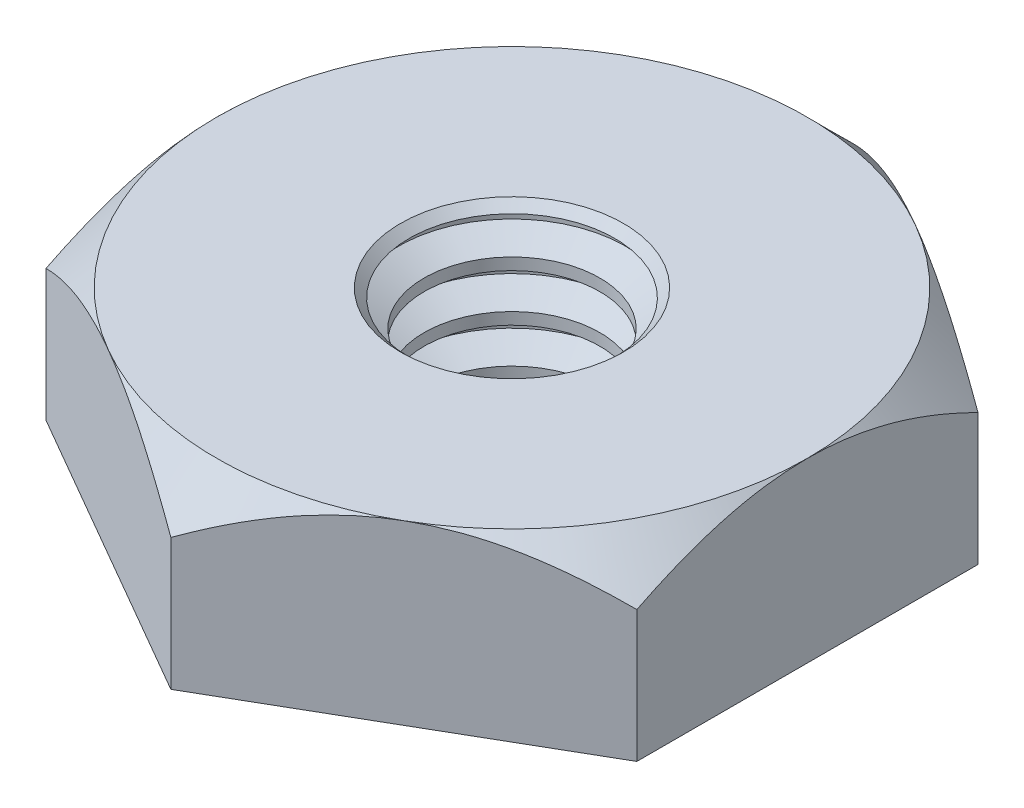
ISO-10303-21;
HEADER;
FILE_DESCRIPTION(('STEP AP214'),'2;1');
FILE_NAME('part.step','',(''),(''),'','','');
FILE_SCHEMA(('AUTOMOTIVE_DESIGN { 1 0 10303 214 1 1 1 1 }'));
ENDSEC;
DATA;
#1=APPLICATION_CONTEXT('core data for automotive mechanical design processes');
#2=APPLICATION_PROTOCOL_DEFINITION('international standard','automotive_design',2000,#1);
#3=PRODUCT_CONTEXT('',#1,'mechanical');
#4=PRODUCT('Part','Part','',(#3));
#5=PRODUCT_RELATED_PRODUCT_CATEGORY('part','',(#4));
#6=PRODUCT_DEFINITION_FORMATION('','',#4);
#7=PRODUCT_DEFINITION_CONTEXT('part definition',#1,'design');
#8=PRODUCT_DEFINITION('design','',#6,#7);
#9=PRODUCT_DEFINITION_SHAPE('','',#8);
#10=(LENGTH_UNIT() NAMED_UNIT(*) SI_UNIT(.MILLI.,.METRE.));
#11=(NAMED_UNIT(*) PLANE_ANGLE_UNIT() SI_UNIT($,.RADIAN.));
#12=(NAMED_UNIT(*) SI_UNIT($,.STERADIAN.) SOLID_ANGLE_UNIT());
#13=UNCERTAINTY_MEASURE_WITH_UNIT(LENGTH_MEASURE(1.E-05),#10,'distance_accuracy_value','');
#14=(GEOMETRIC_REPRESENTATION_CONTEXT(3) GLOBAL_UNCERTAINTY_ASSIGNED_CONTEXT((#13)) GLOBAL_UNIT_ASSIGNED_CONTEXT((#10,
#11,#12)) REPRESENTATION_CONTEXT('',''));
#15=CARTESIAN_POINT('',(0.,0.,0.));
#16=DIRECTION('',(0.,0.,1.));
#17=DIRECTION('',(1.,0.,0.));
#18=AXIS2_PLACEMENT_3D('',#15,#16,#17);
#19=CARTESIAN_POINT('',(0.,1.45716771982052E-13,-2.29135888084666));
#20=DIRECTION('',(0.,1.,0.));
#21=DIRECTION('',(0.,0.,1.00000000000001));
#22=AXIS2_PLACEMENT_3D('',#19,#20,#21);
#23=PLANE('',#22);
#24=DIRECTION('',(-0.866025403784442,0.,-0.500000000000002));
#25=VECTOR('',#24,1.);
#26=CARTESIAN_POINT('',(1.98437500000029,-3.40005801291454E-13,-1.14567944042336));
#27=LINE('',#26,#25);
#28=CARTESIAN_POINT('',(1.98437500000029,-3.40005801291454E-13,-1.14567944042336));
#29=VERTEX_POINT('',#28);
#30=CARTESIAN_POINT('',(0.,1.45716771982052E-13,-2.29135888084666));
#31=VERTEX_POINT('',#30);
#32=EDGE_CURVE('E234',#29,#31,#27,.T.);
#33=ORIENTED_EDGE('',*,*,#32,.F.);
#34=DIRECTION('',(0.,0.,-1.00000000000002));
#35=VECTOR('',#34,1.);
#36=CARTESIAN_POINT('',(1.98437500000005,2.91433543964104E-13,1.14567944042321));
#37=LINE('',#36,#35);
#38=CARTESIAN_POINT('',(1.98437500000005,2.91433543964104E-13,1.14567944042321));
#39=VERTEX_POINT('',#38);
#40=EDGE_CURVE('E291',#39,#29,#37,.T.);
#41=ORIENTED_EDGE('',*,*,#40,.F.);
#42=DIRECTION('',(0.866025403784495,0.,-0.500000000000032));
#43=VECTOR('',#42,1.);
#44=CARTESIAN_POINT('',(2.28983498828939E-13,0.,2.29135888084636));
#45=LINE('',#44,#43);
#46=CARTESIAN_POINT('',(2.28983498828939E-13,0.,2.29135888084636));
#47=VERTEX_POINT('',#46);
#48=EDGE_CURVE('E290',#47,#39,#45,.T.);
#49=ORIENTED_EDGE('',*,*,#48,.F.);
#50=DIRECTION('',(0.866025403784442,0.,0.500000000000002));
#51=VECTOR('',#50,1.);
#52=CARTESIAN_POINT('',(-1.98437499999993,3.88578058618805E-13,1.14567944042318));
#53=LINE('',#52,#51);
#54=CARTESIAN_POINT('',(-1.98437499999993,3.88578058618805E-13,1.14567944042318));
#55=VERTEX_POINT('',#54);
#56=EDGE_CURVE('E126',#55,#47,#53,.T.);
#57=ORIENTED_EDGE('',*,*,#56,.F.);
#58=DIRECTION('',(0.,0.,1.00000000000001));
#59=VECTOR('',#58,1.);
#60=CARTESIAN_POINT('',(-1.98437499999997,-1.45716771982052E-13,-1.14567944042325));
#61=LINE('',#60,#59);
#62=CARTESIAN_POINT('',(-1.98437499999997,-1.45716771982052E-13,-1.14567944042325));
#63=VERTEX_POINT('',#62);
#64=EDGE_CURVE('E296',#63,#55,#61,.T.);
#65=ORIENTED_EDGE('',*,*,#64,.F.);
#66=DIRECTION('',(-0.866025403784495,0.,0.500000000000032));
#67=VECTOR('',#66,1.);
#68=CARTESIAN_POINT('',(0.,1.45716771982052E-13,-2.29135888084666));
#69=LINE('',#68,#67);
#70=EDGE_CURVE('E299',#31,#63,#69,.T.);
#71=ORIENTED_EDGE('',*,*,#70,.F.);
#72=EDGE_LOOP('',(#33,#41,#49,#57,#65,#71));
#73=FACE_BOUND('',#72,.T.);
#74=CARTESIAN_POINT('',(0.,0.,0.));
#75=DIRECTION('',(0.,1.,0.));
#76=DIRECTION('',(0.,0.,1.00000000000001));
#77=AXIS2_PLACEMENT_3D('',#74,#75,#76);
#78=CIRCLE('',#77,0.590148083936524);
#79=CARTESIAN_POINT('',(0.,0.,0.590148083936528));
#80=VERTEX_POINT('',#79);
#81=EDGE_CURVE('E237',#80,#80,#78,.T.);
#82=ORIENTED_EDGE('',*,*,#81,.T.);
#83=EDGE_LOOP('',(#82));
#84=FACE_BOUND('',#83,.T.);
#85=ADVANCED_FACE('F32',(#73,#84),#23,.F.);
#86=CARTESIAN_POINT('',(0.,1.19062500000019,-2.29135888084654));
#87=DIRECTION('',(0.,1.,0.));
#88=DIRECTION('',(0.,0.,1.00000000000001));
#89=AXIS2_PLACEMENT_3D('',#86,#87,#88);
#90=PLANE('',#89);
#91=CARTESIAN_POINT('',(0.,1.19062500000002,0.));
#92=DIRECTION('',(0.,1.,0.));
#93=DIRECTION('',(0.,0.,1.00000000000001));
#94=AXIS2_PLACEMENT_3D('',#91,#92,#93);
#95=CIRCLE('',#94,0.748898083936525);
#96=CARTESIAN_POINT('',(0.,1.19062500000002,0.748898083936498));
#97=VERTEX_POINT('',#96);
#98=EDGE_CURVE('E11',#97,#97,#95,.F.);
#99=ORIENTED_EDGE('',*,*,#98,.T.);
#100=EDGE_LOOP('',(#99));
#101=FACE_BOUND('',#100,.T.);
#102=CARTESIAN_POINT('',(0.,1.19062500000002,0.));
#103=DIRECTION('',(0.,1.,0.));
#104=DIRECTION('',(0.,0.,1.00000000000001));
#105=AXIS2_PLACEMENT_3D('',#102,#103,#104);
#106=CIRCLE('',#105,1.984375);
#107=CARTESIAN_POINT('',(-0.992187500000061,1.19062500000015,1.71851916063472));
#108=VERTEX_POINT('',#107);
#109=CARTESIAN_POINT('',(0.992187500000109,1.19062500000015,1.71851916063475));
#110=VERTEX_POINT('',#109);
#111=EDGE_CURVE('E108',#108,#110,#106,.T.);
#112=ORIENTED_EDGE('',*,*,#111,.T.);
#113=CARTESIAN_POINT('',(0.,1.19062500000002,0.));
#114=DIRECTION('',(0.,1.,0.));
#115=DIRECTION('',(0.,0.,1.00000000000001));
#116=AXIS2_PLACEMENT_3D('',#113,#114,#115);
#117=CIRCLE('',#116,1.984375);
#118=CARTESIAN_POINT('',(1.9843750000002,1.190625,-1.49186218934005E-13));
#119=VERTEX_POINT('',#118);
#120=EDGE_CURVE('E48',#110,#119,#117,.T.);
#121=ORIENTED_EDGE('',*,*,#120,.T.);
#122=CARTESIAN_POINT('',(0.992187500000061,1.19062499999998,-1.71851916063489));
#123=VERTEX_POINT('',#122);
#124=EDGE_CURVE('E141',#119,#123,#106,.T.);
#125=ORIENTED_EDGE('',*,*,#124,.T.);
#126=CARTESIAN_POINT('',(-0.992187499999887,1.19062499999995,-1.71851916063497));
#127=VERTEX_POINT('',#126);
#128=EDGE_CURVE('E145',#123,#127,#106,.T.);
#129=ORIENTED_EDGE('',*,*,#128,.T.);
#130=CARTESIAN_POINT('',(-1.98437499999983,1.1906250000001,0.));
#131=VERTEX_POINT('',#130);
#132=EDGE_CURVE('E148',#127,#131,#106,.T.);
#133=ORIENTED_EDGE('',*,*,#132,.T.);
#134=EDGE_CURVE('E140',#131,#108,#106,.T.);
#135=ORIENTED_EDGE('',*,*,#134,.T.);
#136=EDGE_LOOP('',(#112,#121,#125,#129,#133,#135));
#137=FACE_BOUND('',#136,.T.);
#138=ADVANCED_FACE('F155',(#101,#137),#90,.T.);
#139=CARTESIAN_POINT('',(1.98437500000029,1.19062500000005,-1.14567944042339));
#140=DIRECTION('',(-0.500000000000002,0.,0.866025403784442));
#141=DIRECTION('',(0.866025403784442,0.,0.500000000000002));
#142=AXIS2_PLACEMENT_3D('',#139,#140,#141);
#143=PLANE('',#142);
#144=CARTESIAN_POINT('',(1.9845750000002,0.883525640371882,-1.14556397036938));
#145=CARTESIAN_POINT('',(1.9163590048334,0.922878266889574,-1.18494849354211));
#146=CARTESIAN_POINT('',(1.84700231489325,0.95991980870722,-1.22499159714921));
#147=CARTESIAN_POINT('',(1.70557619954805,1.02774226073004,-1.30664400291425));
#148=CARTESIAN_POINT('',(1.63349332126345,1.05848543006164,-1.34826107209582));
#149=CARTESIAN_POINT('',(1.48814160273421,1.11114923034215,-1.43217992591583));
#150=CARTESIAN_POINT('',(1.41490978751326,1.13320224327334,-1.47446033414689));
#151=CARTESIAN_POINT('',(1.26683381740552,1.16717962620959,-1.55995203534913));
#152=CARTESIAN_POINT('',(1.19199418724684,1.17912936306197,-1.60316071596732));
#153=CARTESIAN_POINT('',(1.06301458545649,1.18991102007171,-1.67762712378094));
#154=CARTESIAN_POINT('',(1.00904128422787,1.19150722009437,-1.70878862377432));
#155=CARTESIAN_POINT('',(0.901182881480525,1.18881928028805,-1.77106070163485));
#156=CARTESIAN_POINT('',(0.847297817514812,1.18453307881295,-1.80217125782076));
#157=CARTESIAN_POINT('',(0.740036461751755,1.1703242461399,-1.8640986304442));
#158=CARTESIAN_POINT('',(0.686660807240232,1.16039530870108,-1.89491507894458));
#159=CARTESIAN_POINT('',(0.58083248259149,1.135446034879,-1.95601509066847));
#160=CARTESIAN_POINT('',(0.528379742029285,1.1204260887643,-1.98629869455186));
#161=CARTESIAN_POINT('',(0.394017661036732,1.0758332675183,-2.06387267818183));
#162=CARTESIAN_POINT('',(0.312941642842077,1.04289812321531,-2.11068193911122));
#163=CARTESIAN_POINT('',(0.19372669327056,0.98729867795128,-2.17951072233773));
#164=CARTESIAN_POINT('',(0.154440075614388,0.967763527101613,-2.20219286161708));
#165=CARTESIAN_POINT('',(0.0765946381322787,0.926912381034187,-2.24713694590256));
#166=CARTESIAN_POINT('',(0.0380353888985849,0.905597479585352,-2.26939913882738));
#167=CARTESIAN_POINT('',(-0.000199999999811462,0.883525640372027,-2.2914743509004));
#168=B_SPLINE_CURVE_WITH_KNOTS('',3,(#144,#145,#146,#147,#148,#149,#150,#151,#152,#153,#154,
#155,#156,#157,#158,#159,#160,#161,#162,#163,#164,#165,#166,#167),.UNSPECIFIED.,.F.,.F.,(4,2,2,
2,2,2,2,2,2,2,2,4),(0.,0.264339630306529,0.530219665093626,0.791876416371418,1.052874244181,
1.23963984393184,1.42647091743834,1.61351120244013,1.8005371524751,2.09764209964292,
2.24579179873695,2.39385111134139),.UNSPECIFIED.);
#169=CARTESIAN_POINT('',(1.98437500000034,0.883641119153724,-1.14567944042333));
#170=VERTEX_POINT('',#169);
#171=EDGE_CURVE('E301',#170,#123,#168,.T.);
#172=ORIENTED_EDGE('',*,*,#171,.F.);
#173=DIRECTION('',(0.,-1.,0.));
#174=VECTOR('',#173,1.);
#175=CARTESIAN_POINT('',(1.98437500000029,1.19062500000005,-1.14567944042339));
#176=LINE('',#175,#174);
#177=EDGE_CURVE('E133',#170,#29,#176,.T.);
#178=ORIENTED_EDGE('',*,*,#177,.T.);
#179=ORIENTED_EDGE('',*,*,#32,.T.);
#180=DIRECTION('',(0.,-1.,0.));
#181=VECTOR('',#180,1.);
#182=CARTESIAN_POINT('',(0.,1.19062500000019,-2.29135888084654));
#183=LINE('',#182,#181);
#184=CARTESIAN_POINT('',(1.2490009027033E-13,0.88364111915387,-2.29135888084661));
#185=VERTEX_POINT('',#184);
#186=EDGE_CURVE('E138',#185,#31,#183,.T.);
#187=ORIENTED_EDGE('',*,*,#186,.F.);
#188=EDGE_CURVE('E206',#123,#185,#168,.T.);
#189=ORIENTED_EDGE('',*,*,#188,.F.);
#190=EDGE_LOOP('',(#172,#178,#179,#187,#189));
#191=FACE_BOUND('',#190,.T.);
#192=ADVANCED_FACE('F34',(#191),#143,.F.);
#193=CARTESIAN_POINT('',(0.,1.19062500000019,-2.29135888084654));
#194=DIRECTION('',(0.50000000000001,0.,0.866025403784456));
#195=DIRECTION('',(0.866025403784456,0.,-0.50000000000001));
#196=AXIS2_PLACEMENT_3D('',#193,#194,#195);
#197=PLANE('',#196);
#198=CARTESIAN_POINT('',(0.000200000000186162,0.883525640372027,-2.29147435090037));
#199=CARTESIAN_POINT('',(-0.068015995166705,0.922878266889732,-2.25208982772778));
#200=CARTESIAN_POINT('',(-0.137372685106893,0.959919808707374,-2.21204672412072));
#201=CARTESIAN_POINT('',(-0.278798800452121,1.02774226073018,-2.13039431835572));
#202=CARTESIAN_POINT('',(-0.3508816787367,1.05848543006178,-2.08877724917415));
#203=CARTESIAN_POINT('',(-0.49623339726591,1.11114923034232,-2.00485839535414));
#204=CARTESIAN_POINT('',(-0.569465212486851,1.13320224327355,-1.9625779871231));
#205=CARTESIAN_POINT('',(-0.717541182594589,1.1671796262097,-1.87708628592085));
#206=CARTESIAN_POINT('',(-0.792380812753271,1.17912936306193,-1.83387760530264));
#207=CARTESIAN_POINT('',(-0.921360414543652,1.18991102007174,-1.75941119748901));
#208=CARTESIAN_POINT('',(-0.97533371577229,1.19150722009453,-1.72824969749563));
#209=CARTESIAN_POINT('',(-1.08319211851966,1.18881928028828,-1.6659776196351));
#210=CARTESIAN_POINT('',(-1.13707718248538,1.18453307881314,-1.63486706344918));
#211=CARTESIAN_POINT('',(-1.24433853824845,1.1703242461401,-1.57293969082572));
#212=CARTESIAN_POINT('',(-1.29771419275999,1.16039530870133,-1.54212324232533));
#213=CARTESIAN_POINT('',(-1.40354251740874,1.13544603487912,-1.48102323060145));
#214=CARTESIAN_POINT('',(-1.45599525797094,1.12042608876425,-1.45073962671809));
#215=CARTESIAN_POINT('',(-1.5903573389635,1.07583326751813,-1.37316564308813));
#216=CARTESIAN_POINT('',(-1.6714333571582,1.04289812321538,-1.32635638215867));
#217=CARTESIAN_POINT('',(-1.79064830672974,0.987298677951452,-1.25752759893214));
#218=CARTESIAN_POINT('',(-1.82993492438591,0.967763527101779,-1.23484545965279));
#219=CARTESIAN_POINT('',(-1.907780361868,0.926912381034287,-1.18990137536732));
#220=CARTESIAN_POINT('',(-1.94633961110167,0.905597479585393,-1.16763918244252));
#221=CARTESIAN_POINT('',(-1.98457500000004,0.883525640372002,-1.14556397036951));
#222=B_SPLINE_CURVE_WITH_KNOTS('',3,(#198,#199,#200,#201,#202,#203,#204,#205,#206,#207,#208,
#209,#210,#211,#212,#213,#214,#215,#216,#217,#218,#219,#220,#221),.UNSPECIFIED.,.F.,.F.,(4,2,2,
2,2,2,2,2,2,2,2,4),(0.,0.264339630306567,0.530219665093623,0.791876416371381,1.05287424418098,
1.23963984393187,1.4264709174384,1.61351120244022,1.80053715247526,2.09764209964308,
2.24579179873709,2.39385111134155),.UNSPECIFIED.);
#223=EDGE_CURVE('E205',#185,#127,#222,.T.);
#224=ORIENTED_EDGE('',*,*,#223,.F.);
#225=ORIENTED_EDGE('',*,*,#186,.T.);
#226=ORIENTED_EDGE('',*,*,#70,.T.);
#227=DIRECTION('',(0.,-1.,0.));
#228=VECTOR('',#227,1.);
#229=CARTESIAN_POINT('',(-1.9843749999998,1.19062500000017,-1.14567944042342));
#230=LINE('',#229,#228);
#231=CARTESIAN_POINT('',(-1.98437499999973,0.883641119153846,-1.14567944042336));
#232=VERTEX_POINT('',#231);
#233=EDGE_CURVE('E131',#232,#63,#230,.T.);
#234=ORIENTED_EDGE('',*,*,#233,.F.);
#235=EDGE_CURVE('E201',#127,#232,#222,.T.);
#236=ORIENTED_EDGE('',*,*,#235,.F.);
#237=EDGE_LOOP('',(#224,#225,#226,#234,#236));
#238=FACE_BOUND('',#237,.T.);
#239=ADVANCED_FACE('F211',(#238),#197,.F.);
#240=CARTESIAN_POINT('',(-1.9843749999998,1.19062500000017,-1.14567944042342));
#241=DIRECTION('',(1.00000000000001,0.,0.));
#242=DIRECTION('',(0.,0.,-1.00000000000001));
#243=AXIS2_PLACEMENT_3D('',#240,#241,#242);
#244=PLANE('',#243);
#245=CARTESIAN_POINT('',(-1.98437500000007,0.0678579907551109,-2.39093858662034));
#246=CARTESIAN_POINT('',(-1.98437499999989,0.1122972409389,-2.33317462993741));
#247=CARTESIAN_POINT('',(-1.98437499999982,0.156338282194557,-2.27509943037781));
#248=CARTESIAN_POINT('',(-1.98437499999977,0.243442020063139,-2.15819933012502));
#249=CARTESIAN_POINT('',(-1.98437499999979,0.286504482746882,-2.09937425531266));
#250=CARTESIAN_POINT('',(-1.9843749999998,0.371775588312892,-1.98041731252039));
#251=CARTESIAN_POINT('',(-1.9843749999998,0.413975081136888,-1.92027886404849));
#252=CARTESIAN_POINT('',(-1.98437499999979,0.496905511909931,-1.79900108789719));
#253=CARTESIAN_POINT('',(-1.98437499999979,0.537636550977846,-1.73786182955753));
#254=CARTESIAN_POINT('',(-1.9843749999998,0.619827468171501,-1.61049038150587));
#255=CARTESIAN_POINT('',(-1.9843749999998,0.661169091834164,-1.5441814987563));
#256=CARTESIAN_POINT('',(-1.98437499999979,0.74127388924578,-1.41002632965806));
#257=CARTESIAN_POINT('',(-1.98437499999979,0.78003739886962,-1.34218024512505));
#258=CARTESIAN_POINT('',(-1.9843749999998,0.854179646043165,-1.2049028594499));
#259=CARTESIAN_POINT('',(-1.98437499999982,0.889567849752302,-1.13547671119946));
#260=CARTESIAN_POINT('',(-1.98437499999977,0.956160104757798,-0.994661805314063));
#261=CARTESIAN_POINT('',(-1.9843749999997,0.987366129905271,-0.923273992828012));
#262=CARTESIAN_POINT('',(-1.98437499999971,1.041645435893,-0.785529199328537));
#263=CARTESIAN_POINT('',(-1.98437499999977,1.06521733345949,-0.719370719882059));
#264=CARTESIAN_POINT('',(-1.98437499999982,1.10706554804224,-0.58536824366753));
#265=CARTESIAN_POINT('',(-1.98437499999981,1.12534152776034,-0.517524139840347));
#266=CARTESIAN_POINT('',(-1.98437499999978,1.15530401629794,-0.381737204849723));
#267=CARTESIAN_POINT('',(-1.98437499999975,1.16711020663641,-0.313821233827045));
#268=CARTESIAN_POINT('',(-1.98437499999984,1.1838868041842,-0.177145514274676));
#269=CARTESIAN_POINT('',(-1.98437499999994,1.18885862962451,-0.108385943793147));
#270=CARTESIAN_POINT('',(-1.98437499999994,1.19154303559346,0.0262685345667429));
#271=CARTESIAN_POINT('',(-1.98437499999983,1.18956325370504,0.0921573633174561));
#272=CARTESIAN_POINT('',(-1.98437499999976,1.17915981582681,0.223420574824771));
#273=CARTESIAN_POINT('',(-1.98437499999978,1.17073557453084,0.288794910308581));
#274=CARTESIAN_POINT('',(-1.98437499999981,1.14777699786801,0.419665277299178));
#275=CARTESIAN_POINT('',(-1.98437499999981,1.13313478805921,0.485142078125713));
#276=CARTESIAN_POINT('',(-1.98437499999978,1.0985501871781,0.614649758192381));
#277=CARTESIAN_POINT('',(-1.98437499999976,1.07860809713262,0.678680719330433));
#278=CARTESIAN_POINT('',(-1.98437499999973,1.00961679847652,0.875717832674248));
#279=CARTESIAN_POINT('',(-1.98437499999978,0.952904639568652,1.00603132226824));
#280=CARTESIAN_POINT('',(-1.98437499999981,0.826700203634045,1.26058195656122));
#281=CARTESIAN_POINT('',(-1.9843749999998,0.757162902292389,1.38479567873725));
#282=CARTESIAN_POINT('',(-1.98437499999979,0.64856757359118,1.56435446887965));
#283=CARTESIAN_POINT('',(-1.98437499999979,0.612658177368547,1.62164227943457));
#284=CARTESIAN_POINT('',(-1.9843749999998,0.539304129574248,1.73523414034348));
#285=CARTESIAN_POINT('',(-1.9843749999998,0.501859362896979,1.7915381164872));
#286=CARTESIAN_POINT('',(-1.98437499999979,0.426020221205967,1.90283779085716));
#287=CARTESIAN_POINT('',(-1.98437499999977,0.387635884291048,1.9578403635737));
#288=CARTESIAN_POINT('',(-1.98437499999982,0.309838254060361,2.06709094817849));
#289=CARTESIAN_POINT('',(-1.98437499999988,0.27042524730878,2.12133916389308));
#290=CARTESIAN_POINT('',(-1.98437500000004,0.230590370952489,2.17527099989928));
#291=B_SPLINE_CURVE_WITH_KNOTS('',3,(#245,#246,#247,#248,#249,#250,#251,#252,#253,#254,#255,
#256,#257,#258,#259,#260,#261,#262,#263,#264,#265,#266,#267,#268,#269,#270,#271,#272,#273,#274,
#275,#276,#277,#278,#279,#280,#281,#282,#283,#284,#285,#286,#287,#288,#289,#290),.UNSPECIFIED.,
.F.,.F.,(4,2,2,2,2,2,2,2,2,2,2,2,2,2,2,2,2,2,2,2,2,2,4),(0.,0.218644571730524,0.43734087201854,
0.65772437219861,0.878092667500268,1.11246911818816,1.34681497442158,1.58048298353887,
1.81404031769145,2.02455568418671,2.23508445550601,2.44157461655698,2.64802192139834,
2.8454504064115,3.042896824632,3.24391843811974,3.44492863626074,3.87005188534782,
4.29669701855881,4.49951372894093,4.70234567224412,4.90354910108082,5.10469706516483),.UNSPECIFIED.);
#292=EDGE_CURVE('E160',#232,#131,#291,.T.);
#293=ORIENTED_EDGE('',*,*,#292,.F.);
#294=ORIENTED_EDGE('',*,*,#233,.T.);
#295=ORIENTED_EDGE('',*,*,#64,.T.);
#296=DIRECTION('',(0.,-1.,0.));
#297=VECTOR('',#296,1.);
#298=CARTESIAN_POINT('',(-1.98437499999994,1.19062500000005,1.14567944042317));
#299=LINE('',#298,#297);
#300=CARTESIAN_POINT('',(-1.98437499999995,0.883641119153724,1.14567944042315));
#301=VERTEX_POINT('',#300);
#302=EDGE_CURVE('E128',#301,#55,#299,.T.);
#303=ORIENTED_EDGE('',*,*,#302,.F.);
#304=EDGE_CURVE('E158',#131,#301,#291,.T.);
#305=ORIENTED_EDGE('',*,*,#304,.F.);
#306=EDGE_LOOP('',(#293,#294,#295,#303,#305));
#307=FACE_BOUND('',#306,.T.);
#308=ADVANCED_FACE('F214',(#307),#244,.F.);
#309=CARTESIAN_POINT('',(-1.98437499999994,1.19062500000005,1.14567944042317));
#310=DIRECTION('',(0.500000000000002,0.,-0.866025403784442));
#311=DIRECTION('',(-0.866025403784442,0.,-0.500000000000002));
#312=AXIS2_PLACEMENT_3D('',#309,#310,#311);
#313=PLANE('',#312);
#314=CARTESIAN_POINT('',(-1.98457499999975,0.883525640371881,1.14556397036933));
#315=CARTESIAN_POINT('',(-1.91635900483301,0.922878266889828,1.18494849354195));
#316=CARTESIAN_POINT('',(-1.84700231489289,0.959919808707568,1.22499159714902));
#317=CARTESIAN_POINT('',(-1.70557619954771,1.02774226073043,1.30664400291403));
#318=CARTESIAN_POINT('',(-1.63349332126312,1.058485430062,1.3482610720956));
#319=CARTESIAN_POINT('',(-1.48814160273391,1.11114923034249,1.43217992591559));
#320=CARTESIAN_POINT('',(-1.41490978751298,1.13320224327371,1.47446033414662));
#321=CARTESIAN_POINT('',(-1.26683381740528,1.16717962620986,1.55995203534888));
#322=CARTESIAN_POINT('',(-1.19199418724663,1.17912936306211,1.60316071596711));
#323=CARTESIAN_POINT('',(-1.06301458545626,1.1899110200719,1.67762712378072));
#324=CARTESIAN_POINT('',(-1.0090412842276,1.19150722009465,1.70878862377408));
#325=CARTESIAN_POINT('',(-0.901182881480221,1.18881928028837,1.77106070163459));
#326=CARTESIAN_POINT('',(-0.847297817514505,1.18453307881323,1.80217125782052));
#327=CARTESIAN_POINT('',(-0.740036461751428,1.17032424614018,1.86409863044398));
#328=CARTESIAN_POINT('',(-0.686660807239889,1.16039530870141,1.89491507894439));
#329=CARTESIAN_POINT('',(-0.580832482591122,1.13544603487917,1.95601509066824));
#330=CARTESIAN_POINT('',(-0.528379742028908,1.12042608876427,1.98629869455157));
#331=CARTESIAN_POINT('',(-0.394017661036339,1.07583326751811,2.06387267818151));
#332=CARTESIAN_POINT('',(-0.312941642841664,1.04289812321538,2.11068193911102));
#333=CARTESIAN_POINT('',(-0.193726693270132,0.98729867795147,2.17951072233758));
#334=CARTESIAN_POINT('',(-0.154440075613961,0.967763527101803,2.20219286161692));
#335=CARTESIAN_POINT('',(-0.0765946381318904,0.926912381034268,2.24713694590237));
#336=CARTESIAN_POINT('',(-0.0380353888982353,0.905597479585324,2.26939913882717));
#337=CARTESIAN_POINT('',(0.00020000000007514,0.883525640371832,2.29147435090018));
#338=B_SPLINE_CURVE_WITH_KNOTS('',3,(#314,#315,#316,#317,#318,#319,#320,#321,#322,#323,#324,
#325,#326,#327,#328,#329,#330,#331,#332,#333,#334,#335,#336,#337),.UNSPECIFIED.,.F.,.F.,(4,2,2,
2,2,2,2,2,2,2,2,4),(0.,0.264339630306556,0.530219665093593,0.791876416371302,1.05287424418085,
1.23963984393176,1.42647091743828,1.61351120244011,1.80053715247517,2.09764209964299,
2.245791798737,2.39385111134146),.UNSPECIFIED.);
#339=EDGE_CURVE('E113',#301,#108,#338,.T.);
#340=ORIENTED_EDGE('',*,*,#339,.F.);
#341=ORIENTED_EDGE('',*,*,#302,.T.);
#342=ORIENTED_EDGE('',*,*,#56,.T.);
#343=DIRECTION('',(0.,-1.,0.));
#344=VECTOR('',#343,1.);
#345=CARTESIAN_POINT('',(2.56739074444567E-13,1.190625,2.29135888084642));
#346=LINE('',#345,#344);
#347=CARTESIAN_POINT('',(2.4980018054066E-13,0.883641119153676,2.29135888084643));
#348=VERTEX_POINT('',#347);
#349=EDGE_CURVE('E119',#348,#47,#346,.T.);
#350=ORIENTED_EDGE('',*,*,#349,.F.);
#351=EDGE_CURVE('E104',#108,#348,#338,.T.);
#352=ORIENTED_EDGE('',*,*,#351,.F.);
#353=EDGE_LOOP('',(#340,#341,#342,#350,#352));
#354=FACE_BOUND('',#353,.T.);
#355=ADVANCED_FACE('F124',(#354),#313,.F.);
#356=CARTESIAN_POINT('',(2.56739074444567E-13,1.190625,2.29135888084642));
#357=DIRECTION('',(-0.50000000000001,0.,-0.866025403784456));
#358=DIRECTION('',(-0.866025403784495,0.,0.500000000000032));
#359=AXIS2_PLACEMENT_3D('',#356,#357,#358);
#360=PLANE('',#359);
#361=CARTESIAN_POINT('',(-0.00019999999988779,0.883525640371832,2.29147435090016));
#362=CARTESIAN_POINT('',(0.0680159951669985,0.922878266889646,2.25208982772766));
#363=CARTESIAN_POINT('',(0.137372685107182,0.95991980870735,2.21204672412063));
#364=CARTESIAN_POINT('',(0.278798800452433,1.02774226073021,2.13039431835562));
#365=CARTESIAN_POINT('',(0.350881678737038,1.05848543006181,2.08877724917402));
#366=CARTESIAN_POINT('',(0.496233397266294,1.11114923034228,2.00485839535401));
#367=CARTESIAN_POINT('',(0.569465212487252,1.13320224327344,1.96257798712299));
#368=CARTESIAN_POINT('',(0.71754118259492,1.16717962620971,1.87708628592069));
#369=CARTESIAN_POINT('',(0.792380812753514,1.17912936306213,1.8338776053024));
#370=CARTESIAN_POINT('',(0.921360414543898,1.18991102007185,1.75941119748881));
#371=CARTESIAN_POINT('',(0.975333715772589,1.19150722009446,1.7282496974955));
#372=CARTESIAN_POINT('',(1.08319211852,1.18881928028809,1.66597761963501));
#373=CARTESIAN_POINT('',(1.13707718248572,1.18453307881298,1.63486706344907));
#374=CARTESIAN_POINT('',(1.24433853824881,1.17032424613994,1.57293969082559));
#375=CARTESIAN_POINT('',(1.29771419276037,1.16039530870114,1.54212324232519));
#376=CARTESIAN_POINT('',(1.40354251740915,1.13544603487892,1.4810232306013));
#377=CARTESIAN_POINT('',(1.45599525797136,1.12042608876407,1.45073962671791));
#378=CARTESIAN_POINT('',(1.59035733896392,1.07583326751794,1.37316564308794));
#379=CARTESIAN_POINT('',(1.67143335715862,1.04289812321513,1.3263563821585));
#380=CARTESIAN_POINT('',(1.79064830673014,0.987298677951163,1.25752759893198));
#381=CARTESIAN_POINT('',(1.8299349243863,0.96776352710148,1.23484545965264));
#382=CARTESIAN_POINT('',(1.90778036186839,0.926912381034019,1.18990137536717));
#383=CARTESIAN_POINT('',(1.94633961110208,0.905597479585164,1.16763918244236));
#384=CARTESIAN_POINT('',(1.98457500000047,0.883525640371857,1.14556397036934));
#385=B_SPLINE_CURVE_WITH_KNOTS('',3,(#361,#362,#363,#364,#365,#366,#367,#368,#369,#370,#371,
#372,#373,#374,#375,#376,#377,#378,#379,#380,#381,#382,#383,#384),.UNSPECIFIED.,.F.,.F.,(4,2,2,
2,2,2,2,2,2,2,2,4),(0.,0.264339630306588,0.530219665093735,0.791876416371477,1.05287424418102,
1.23963984393193,1.42647091743849,1.61351120244037,1.80053715247545,2.09764209964327,
2.24579179873727,2.39385111134171),.UNSPECIFIED.);
#386=EDGE_CURVE('E107',#348,#110,#385,.T.);
#387=ORIENTED_EDGE('',*,*,#386,.F.);
#388=ORIENTED_EDGE('',*,*,#349,.T.);
#389=ORIENTED_EDGE('',*,*,#48,.T.);
#390=DIRECTION('',(0.,-1.,0.));
#391=VECTOR('',#390,1.);
#392=CARTESIAN_POINT('',(1.98437500000009,1.19062500000002,1.14567944042316));
#393=LINE('',#392,#391);
#394=CARTESIAN_POINT('',(1.98437500000009,0.8836411191537,1.14567944042314));
#395=VERTEX_POINT('',#394);
#396=EDGE_CURVE('E129',#395,#39,#393,.T.);
#397=ORIENTED_EDGE('',*,*,#396,.F.);
#398=EDGE_CURVE('E122',#110,#395,#385,.T.);
#399=ORIENTED_EDGE('',*,*,#398,.F.);
#400=EDGE_LOOP('',(#387,#388,#389,#397,#399));
#401=FACE_BOUND('',#400,.T.);
#402=ADVANCED_FACE('F117',(#401),#360,.F.);
#403=CARTESIAN_POINT('',(1.98437500000009,1.19062500000002,1.14567944042316));
#404=DIRECTION('',(-1.00000000000002,0.,0.));
#405=DIRECTION('',(0.,0.,1.00000000000002));
#406=AXIS2_PLACEMENT_3D('',#403,#404,#405);
#407=PLANE('',#406);
#408=CARTESIAN_POINT('',(1.98437499999998,0.0678579907549184,-2.39093858662029));
#409=CARTESIAN_POINT('',(1.98437500000005,0.112297240938723,-2.33317462993737));
#410=CARTESIAN_POINT('',(1.98437500000008,0.156338282194383,-2.27509943037778));
#411=CARTESIAN_POINT('',(1.9843750000001,0.243442020062961,-2.15819933012501));
#412=CARTESIAN_POINT('',(1.98437500000009,0.286504482746697,-2.09937425531264));
#413=CARTESIAN_POINT('',(1.98437500000008,0.371775588312703,-1.98041731252037));
#414=CARTESIAN_POINT('',(1.98437500000009,0.413975081136701,-1.92027886404845));
#415=CARTESIAN_POINT('',(1.98437500000009,0.496905511909748,-1.79900108789714));
#416=CARTESIAN_POINT('',(1.98437500000009,0.537636550977663,-1.73786182955748));
#417=CARTESIAN_POINT('',(1.98437500000009,0.619827468171318,-1.6104903815058));
#418=CARTESIAN_POINT('',(1.98437500000008,0.661169091833979,-1.54418149875623));
#419=CARTESIAN_POINT('',(1.98437500000009,0.741273889245598,-1.41002632965797));
#420=CARTESIAN_POINT('',(1.98437500000011,0.780037398869444,-1.34218024512495));
#421=CARTESIAN_POINT('',(1.98437500000007,0.854179646042962,-1.20490285944979));
#422=CARTESIAN_POINT('',(1.98437500000002,0.889567849752066,-1.13547671119934));
#423=CARTESIAN_POINT('',(1.98437500000015,0.956160104757623,-0.994661805313971));
#424=CARTESIAN_POINT('',(1.98437500000034,0.98736612990519,-0.923273992827964));
#425=CARTESIAN_POINT('',(1.98437500000032,1.04164543589289,-0.785529199328496));
#426=CARTESIAN_POINT('',(1.98437500000015,1.06521733345928,-0.719370719881988));
#427=CARTESIAN_POINT('',(1.98437500000002,1.10706554804195,-0.585368243667436));
#428=CARTESIAN_POINT('',(1.98437500000007,1.12534152776008,-0.517524139840261));
#429=CARTESIAN_POINT('',(1.9843750000001,1.15530401629766,-0.381737204849641));
#430=CARTESIAN_POINT('',(1.98437500000009,1.16711020663608,-0.313821233826958));
#431=CARTESIAN_POINT('',(1.98437500000008,1.18388680418397,-0.177145514274601));
#432=CARTESIAN_POINT('',(1.98437500000009,1.18885862962442,-0.108385943793088));
#433=CARTESIAN_POINT('',(1.98437500000009,1.19154303559335,0.0262685345667733));
#434=CARTESIAN_POINT('',(1.98437500000009,1.1895632537048,0.0921573633174742));
#435=CARTESIAN_POINT('',(1.98437500000009,1.17915981582647,0.223420574824778));
#436=CARTESIAN_POINT('',(1.9843750000001,1.17073557453054,0.288794910308588));
#437=CARTESIAN_POINT('',(1.98437500000008,1.14777699786773,0.419665277299178));
#438=CARTESIAN_POINT('',(1.98437500000005,1.1331347880589,0.485142078125705));
#439=CARTESIAN_POINT('',(1.98437500000013,1.09855018717785,0.614649758192384));
#440=CARTESIAN_POINT('',(1.98437500000024,1.07860809713246,0.678680719330455));
#441=CARTESIAN_POINT('',(1.98437500000038,1.00961679847648,0.875717832674286));
#442=CARTESIAN_POINT('',(1.98437500000016,0.952904639568467,1.00603132226822));
#443=CARTESIAN_POINT('',(1.98437500000001,0.826700203633762,1.26058195656116));
#444=CARTESIAN_POINT('',(1.98437500000007,0.757162902292154,1.38479567873723));
#445=CARTESIAN_POINT('',(1.98437500000009,0.648567573590959,1.56435446887965));
#446=CARTESIAN_POINT('',(1.98437500000009,0.612658177368322,1.62164227943457));
#447=CARTESIAN_POINT('',(1.98437500000008,0.539304129574021,1.73523414034349));
#448=CARTESIAN_POINT('',(1.98437500000008,0.501859362896754,1.79153811648721));
#449=CARTESIAN_POINT('',(1.98437500000009,0.42602022120574,1.90283779085718));
#450=CARTESIAN_POINT('',(1.9843750000001,0.387635884290817,1.95784036357371));
#451=CARTESIAN_POINT('',(1.98437500000008,0.309838254060165,2.06709094817851));
#452=CARTESIAN_POINT('',(1.98437500000005,0.270425247308623,2.12133916389312));
#453=CARTESIAN_POINT('',(1.984375,0.230590370952417,2.17527099989937));
#454=B_SPLINE_CURVE_WITH_KNOTS('',3,(#408,#409,#410,#411,#412,#413,#414,#415,#416,#417,#418,
#419,#420,#421,#422,#423,#424,#425,#426,#427,#428,#429,#430,#431,#432,#433,#434,#435,#436,#437,
#438,#439,#440,#441,#442,#443,#444,#445,#446,#447,#448,#449,#450,#451,#452,#453),.UNSPECIFIED.,
.F.,.F.,(4,2,2,2,2,2,2,2,2,2,2,2,2,2,2,2,2,2,2,2,2,2,4),(0.,0.218644571730508,0.437340872018512,
0.657724372198603,0.87809266750028,1.11246911818819,1.34681497442163,1.58048298353892,
1.81404031769148,2.02455568418672,2.23508445550602,2.44157461655699,2.64802192139832,
2.84545040641144,3.04289682463195,3.24391843811968,3.44492863626066,3.87005188534771,
4.29669701855873,4.49951372894087,4.70234567224407,4.90354910108076,5.10469706516474),.UNSPECIFIED.);
#455=EDGE_CURVE('E282',#395,#119,#454,.F.);
#456=ORIENTED_EDGE('',*,*,#455,.F.);
#457=ORIENTED_EDGE('',*,*,#396,.T.);
#458=ORIENTED_EDGE('',*,*,#40,.T.);
#459=ORIENTED_EDGE('',*,*,#177,.F.);
#460=EDGE_CURVE('E191',#119,#170,#454,.F.);
#461=ORIENTED_EDGE('',*,*,#460,.F.);
#462=EDGE_LOOP('',(#456,#457,#458,#459,#461));
#463=FACE_BOUND('',#462,.T.);
#464=ADVANCED_FACE('F287',(#463),#407,.F.);
#465=CARTESIAN_POINT('',(0.,1.19062500000002,0.));
#466=DIRECTION('',(0.,-1.,0.));
#467=DIRECTION('',(0.,0.,-1.00000000000001));
#468=AXIS2_PLACEMENT_3D('',#465,#466,#467);
#469=CONICAL_SURFACE('',#468,1.984375,0.785398163397454);
#470=ORIENTED_EDGE('',*,*,#351,.T.);
#471=ORIENTED_EDGE('',*,*,#386,.T.);
#472=ORIENTED_EDGE('',*,*,#111,.F.);
#473=EDGE_LOOP('',(#470,#471,#472));
#474=FACE_BOUND('',#473,.T.);
#475=ADVANCED_FACE('F106',(#474),#469,.T.);
#476=ORIENTED_EDGE('',*,*,#304,.T.);
#477=ORIENTED_EDGE('',*,*,#339,.T.);
#478=ORIENTED_EDGE('',*,*,#134,.F.);
#479=EDGE_LOOP('',(#476,#477,#478));
#480=FACE_BOUND('',#479,.T.);
#481=ADVANCED_FACE('F157',(#480),#469,.T.);
#482=ORIENTED_EDGE('',*,*,#235,.T.);
#483=ORIENTED_EDGE('',*,*,#292,.T.);
#484=ORIENTED_EDGE('',*,*,#132,.F.);
#485=EDGE_LOOP('',(#482,#483,#484));
#486=FACE_BOUND('',#485,.T.);
#487=ADVANCED_FACE('F307',(#486),#469,.T.);
#488=ORIENTED_EDGE('',*,*,#188,.T.);
#489=ORIENTED_EDGE('',*,*,#223,.T.);
#490=ORIENTED_EDGE('',*,*,#128,.F.);
#491=EDGE_LOOP('',(#488,#489,#490));
#492=FACE_BOUND('',#491,.T.);
#493=ADVANCED_FACE('F184',(#492),#469,.T.);
#494=ORIENTED_EDGE('',*,*,#171,.T.);
#495=ORIENTED_EDGE('',*,*,#124,.F.);
#496=ORIENTED_EDGE('',*,*,#460,.T.);
#497=EDGE_LOOP('',(#494,#495,#496));
#498=FACE_BOUND('',#497,.T.);
#499=ADVANCED_FACE('F178',(#498),#469,.T.);
#500=ORIENTED_EDGE('',*,*,#398,.T.);
#501=ORIENTED_EDGE('',*,*,#455,.T.);
#502=ORIENTED_EDGE('',*,*,#120,.F.);
#503=EDGE_LOOP('',(#500,#501,#502));
#504=FACE_BOUND('',#503,.T.);
#505=ADVANCED_FACE('F183',(#504),#469,.T.);
#506=CARTESIAN_POINT('',(1.04083408558608E-13,1.09140625000002,0.));
#507=DIRECTION('',(0.,-1.,0.));
#508=DIRECTION('',(0.,0.,-1.00000000000001));
#509=AXIS2_PLACEMENT_3D('',#506,#507,#508);
#510=CONICAL_SURFACE('',#509,0.762,1.0471975511966);
#511=CARTESIAN_POINT('',(1.04083408558608E-13,1.13251846714924,0.));
#512=DIRECTION('',(0.,1.,0.));
#513=DIRECTION('',(0.,0.,1.00000000000001));
#514=AXIS2_PLACEMENT_3D('',#511,#512,#513);
#515=CIRCLE('',#514,0.690791551085745);
#516=CARTESIAN_POINT('',(1.04198448461393E-13,1.13251846714924,0.690791551085697));
#517=VERTEX_POINT('',#516);
#518=EDGE_CURVE('E41',#517,#517,#515,.T.);
#519=ORIENTED_EDGE('',*,*,#518,.T.);
#520=EDGE_LOOP('',(#519));
#521=FACE_BOUND('',#520,.T.);
#522=CARTESIAN_POINT('',(1.04083408558608E-13,1.09140625000002,0.));
#523=DIRECTION('',(0.,1.,0.));
#524=DIRECTION('',(0.,0.,1.00000000000001));
#525=AXIS2_PLACEMENT_3D('',#522,#523,#524);
#526=CIRCLE('',#525,0.762);
#527=CARTESIAN_POINT('',(1.04210307050323E-13,1.09140625000002,0.761999999999953));
#528=VERTEX_POINT('',#527);
#529=EDGE_CURVE('E280',#528,#528,#526,.T.);
#530=ORIENTED_EDGE('',*,*,#529,.F.);
#531=EDGE_LOOP('',(#530));
#532=FACE_BOUND('',#531,.T.);
#533=ADVANCED_FACE('F186',(#521,#532),#510,.F.);
#534=CARTESIAN_POINT('',(0.,1.66357854098432,0.));
#535=DIRECTION('',(0.,1.,0.));
#536=DIRECTION('',(0.,0.,1.00000000000001));
#537=AXIS2_PLACEMENT_3D('',#534,#535,#536);
#538=CYLINDRICAL_SURFACE('',#537,0.762);
#539=ORIENTED_EDGE('',*,*,#529,.T.);
#540=EDGE_LOOP('',(#539));
#541=FACE_BOUND('',#540,.T.);
#542=CARTESIAN_POINT('',(1.04083408558608E-13,1.05171875000002,0.));
#543=DIRECTION('',(0.,1.,0.));
#544=DIRECTION('',(0.,0.,1.00000000000001));
#545=AXIS2_PLACEMENT_3D('',#542,#543,#544);
#546=CIRCLE('',#545,0.762);
#547=CARTESIAN_POINT('',(1.04210307050323E-13,1.05171875000002,0.761999999999953));
#548=VERTEX_POINT('',#547);
#549=EDGE_CURVE('E277',#548,#548,#546,.T.);
#550=ORIENTED_EDGE('',*,*,#549,.F.);
#551=EDGE_LOOP('',(#550));
#552=FACE_BOUND('',#551,.T.);
#553=ADVANCED_FACE('F394',(#541,#552),#538,.F.);
#554=CARTESIAN_POINT('',(0.,0.952500000000025,0.));
#555=DIRECTION('',(0.,1.,0.));
#556=DIRECTION('',(0.,0.,1.00000000000001));
#557=AXIS2_PLACEMENT_3D('',#554,#555,#556);
#558=CONICAL_SURFACE('',#557,0.590148083936524,1.0471975511966);
#559=ORIENTED_EDGE('',*,*,#549,.T.);
#560=EDGE_LOOP('',(#559));
#561=FACE_BOUND('',#560,.T.);
#562=CARTESIAN_POINT('',(0.,0.952500000000025,0.));
#563=DIRECTION('',(0.,1.,0.));
#564=DIRECTION('',(0.,0.,1.00000000000001));
#565=AXIS2_PLACEMENT_3D('',#562,#563,#564);
#566=CIRCLE('',#565,0.590148083936524);
#567=CARTESIAN_POINT('',(0.,0.952500000000025,0.590148083936472));
#568=VERTEX_POINT('',#567);
#569=EDGE_CURVE('E274',#568,#568,#566,.T.);
#570=ORIENTED_EDGE('',*,*,#569,.F.);
#571=EDGE_LOOP('',(#570));
#572=FACE_BOUND('',#571,.T.);
#573=ADVANCED_FACE('F402',(#561,#572),#558,.F.);
#574=CARTESIAN_POINT('',(0.,1.66357854098432,0.));
#575=DIRECTION('',(0.,1.,0.));
#576=DIRECTION('',(0.,0.,1.00000000000001));
#577=AXIS2_PLACEMENT_3D('',#574,#575,#576);
#578=CYLINDRICAL_SURFACE('',#577,0.590148083936524);
#579=ORIENTED_EDGE('',*,*,#569,.T.);
#580=EDGE_LOOP('',(#579));
#581=FACE_BOUND('',#580,.T.);
#582=CARTESIAN_POINT('',(0.,0.873125000000024,0.));
#583=DIRECTION('',(0.,1.,0.));
#584=DIRECTION('',(0.,0.,1.00000000000001));
#585=AXIS2_PLACEMENT_3D('',#582,#583,#584);
#586=CIRCLE('',#585,0.590148083936524);
#587=CARTESIAN_POINT('',(0.,0.873125000000024,0.590148083936472));
#588=VERTEX_POINT('',#587);
#589=EDGE_CURVE('E271',#588,#588,#586,.T.);
#590=ORIENTED_EDGE('',*,*,#589,.F.);
#591=EDGE_LOOP('',(#590));
#592=FACE_BOUND('',#591,.T.);
#593=ADVANCED_FACE('F411',(#581,#592),#578,.F.);
#594=CARTESIAN_POINT('',(1.31838984174237E-13,0.773906250000024,0.));
#595=DIRECTION('',(0.,-1.,0.));
#596=DIRECTION('',(0.,0.,-1.00000000000001));
#597=AXIS2_PLACEMENT_3D('',#594,#595,#596);
#598=CONICAL_SURFACE('',#597,0.762,1.0471975511966);
#599=ORIENTED_EDGE('',*,*,#589,.T.);
#600=EDGE_LOOP('',(#599));
#601=FACE_BOUND('',#600,.T.);
#602=CARTESIAN_POINT('',(1.31838984174237E-13,0.773906250000024,0.));
#603=DIRECTION('',(0.,1.,0.));
#604=DIRECTION('',(0.,0.,1.00000000000001));
#605=AXIS2_PLACEMENT_3D('',#602,#603,#604);
#606=CIRCLE('',#605,0.762);
#607=CARTESIAN_POINT('',(1.31965882665952E-13,0.773906250000024,0.761999999999946));
#608=VERTEX_POINT('',#607);
#609=EDGE_CURVE('E268',#608,#608,#606,.T.);
#610=ORIENTED_EDGE('',*,*,#609,.F.);
#611=EDGE_LOOP('',(#610));
#612=FACE_BOUND('',#611,.T.);
#613=ADVANCED_FACE('F421',(#601,#612),#598,.F.);
#614=CARTESIAN_POINT('',(0.,1.34607854098432,0.));
#615=DIRECTION('',(0.,1.,0.));
#616=DIRECTION('',(0.,0.,1.00000000000001));
#617=AXIS2_PLACEMENT_3D('',#614,#615,#616);
#618=CYLINDRICAL_SURFACE('',#617,0.762);
#619=ORIENTED_EDGE('',*,*,#609,.T.);
#620=EDGE_LOOP('',(#619));
#621=FACE_BOUND('',#620,.T.);
#622=CARTESIAN_POINT('',(1.31838984174237E-13,0.734218750000024,0.));
#623=DIRECTION('',(0.,1.,0.));
#624=DIRECTION('',(0.,0.,1.00000000000001));
#625=AXIS2_PLACEMENT_3D('',#622,#623,#624);
#626=CIRCLE('',#625,0.762);
#627=CARTESIAN_POINT('',(1.31965882665952E-13,0.734218750000024,0.761999999999946));
#628=VERTEX_POINT('',#627);
#629=EDGE_CURVE('E265',#628,#628,#626,.T.);
#630=ORIENTED_EDGE('',*,*,#629,.F.);
#631=EDGE_LOOP('',(#630));
#632=FACE_BOUND('',#631,.T.);
#633=ADVANCED_FACE('F432',(#621,#632),#618,.F.);
#634=CARTESIAN_POINT('',(1.04083408558608E-13,0.635000000000024,0.));
#635=DIRECTION('',(0.,1.,0.));
#636=DIRECTION('',(0.,0.,1.00000000000001));
#637=AXIS2_PLACEMENT_3D('',#634,#635,#636);
#638=CONICAL_SURFACE('',#637,0.590148083936524,1.0471975511966);
#639=ORIENTED_EDGE('',*,*,#629,.T.);
#640=EDGE_LOOP('',(#639));
#641=FACE_BOUND('',#640,.T.);
#642=CARTESIAN_POINT('',(1.04083408558608E-13,0.635000000000024,0.));
#643=DIRECTION('',(0.,1.,0.));
#644=DIRECTION('',(0.,0.,1.00000000000001));
#645=AXIS2_PLACEMENT_3D('',#642,#643,#644);
#646=CIRCLE('',#645,0.590148083936524);
#647=CARTESIAN_POINT('',(1.04181687957217E-13,0.635000000000024,0.590148083936476));
#648=VERTEX_POINT('',#647);
#649=EDGE_CURVE('E262',#648,#648,#646,.T.);
#650=ORIENTED_EDGE('',*,*,#649,.F.);
#651=EDGE_LOOP('',(#650));
#652=FACE_BOUND('',#651,.T.);
#653=ADVANCED_FACE('F442',(#641,#652),#638,.F.);
#654=CARTESIAN_POINT('',(0.,1.34607854098432,0.));
#655=DIRECTION('',(0.,1.,0.));
#656=DIRECTION('',(0.,0.,1.00000000000001));
#657=AXIS2_PLACEMENT_3D('',#654,#655,#656);
#658=CYLINDRICAL_SURFACE('',#657,0.590148083936524);
#659=ORIENTED_EDGE('',*,*,#649,.T.);
#660=EDGE_LOOP('',(#659));
#661=FACE_BOUND('',#660,.T.);
#662=CARTESIAN_POINT('',(1.17961196366423E-13,0.555625000000024,0.));
#663=DIRECTION('',(0.,1.,0.));
#664=DIRECTION('',(0.,0.,1.00000000000001));
#665=AXIS2_PLACEMENT_3D('',#662,#663,#664);
#666=CIRCLE('',#665,0.590148083936524);
#667=CARTESIAN_POINT('',(1.18059475765032E-13,0.555625000000024,0.590148083936476));
#668=VERTEX_POINT('',#667);
#669=EDGE_CURVE('E259',#668,#668,#666,.T.);
#670=ORIENTED_EDGE('',*,*,#669,.F.);
#671=EDGE_LOOP('',(#670));
#672=FACE_BOUND('',#671,.T.);
#673=ADVANCED_FACE('F452',(#661,#672),#658,.F.);
#674=CARTESIAN_POINT('',(0.,0.456406250000024,0.));
#675=DIRECTION('',(0.,-1.,0.));
#676=DIRECTION('',(0.,0.,-1.00000000000001));
#677=AXIS2_PLACEMENT_3D('',#674,#675,#676);
#678=CONICAL_SURFACE('',#677,0.762,1.0471975511966);
#679=ORIENTED_EDGE('',*,*,#669,.T.);
#680=EDGE_LOOP('',(#679));
#681=FACE_BOUND('',#680,.T.);
#682=CARTESIAN_POINT('',(0.,0.456406250000024,0.));
#683=DIRECTION('',(0.,1.,0.));
#684=DIRECTION('',(0.,0.,1.00000000000001));
#685=AXIS2_PLACEMENT_3D('',#682,#683,#684);
#686=CIRCLE('',#685,0.762);
#687=CARTESIAN_POINT('',(0.,0.456406250000024,0.761999999999977));
#688=VERTEX_POINT('',#687);
#689=EDGE_CURVE('E256',#688,#688,#686,.T.);
#690=ORIENTED_EDGE('',*,*,#689,.F.);
#691=EDGE_LOOP('',(#690));
#692=FACE_BOUND('',#691,.T.);
#693=ADVANCED_FACE('F462',(#681,#692),#678,.F.);
#694=CARTESIAN_POINT('',(1.04083408558608E-13,1.02857854098432,0.));
#695=DIRECTION('',(0.,1.,0.));
#696=DIRECTION('',(0.,0.,1.00000000000001));
#697=AXIS2_PLACEMENT_3D('',#694,#695,#696);
#698=CYLINDRICAL_SURFACE('',#697,0.762);
#699=ORIENTED_EDGE('',*,*,#689,.T.);
#700=EDGE_LOOP('',(#699));
#701=FACE_BOUND('',#700,.T.);
#702=CARTESIAN_POINT('',(0.,0.416718750000025,0.));
#703=DIRECTION('',(0.,1.,0.));
#704=DIRECTION('',(0.,0.,1.00000000000001));
#705=AXIS2_PLACEMENT_3D('',#702,#703,#704);
#706=CIRCLE('',#705,0.762);
#707=CARTESIAN_POINT('',(0.,0.416718750000025,0.761999999999977));
#708=VERTEX_POINT('',#707);
#709=EDGE_CURVE('E253',#708,#708,#706,.T.);
#710=ORIENTED_EDGE('',*,*,#709,.F.);
#711=EDGE_LOOP('',(#710));
#712=FACE_BOUND('',#711,.T.);
#713=ADVANCED_FACE('F472',(#701,#712),#698,.F.);
#714=CARTESIAN_POINT('',(0.,0.317500000000024,0.));
#715=DIRECTION('',(0.,1.,0.));
#716=DIRECTION('',(0.,0.,1.00000000000001));
#717=AXIS2_PLACEMENT_3D('',#714,#715,#716);
#718=CONICAL_SURFACE('',#717,0.590148083936524,1.0471975511966);
#719=ORIENTED_EDGE('',*,*,#709,.T.);
#720=EDGE_LOOP('',(#719));
#721=FACE_BOUND('',#720,.T.);
#722=CARTESIAN_POINT('',(0.,0.317500000000024,0.));
#723=DIRECTION('',(0.,1.,0.));
#724=DIRECTION('',(0.,0.,1.00000000000001));
#725=AXIS2_PLACEMENT_3D('',#722,#723,#724);
#726=CIRCLE('',#725,0.590148083936524);
#727=CARTESIAN_POINT('',(0.,0.317500000000024,0.590148083936504));
#728=VERTEX_POINT('',#727);
#729=EDGE_CURVE('E250',#728,#728,#726,.T.);
#730=ORIENTED_EDGE('',*,*,#729,.F.);
#731=EDGE_LOOP('',(#730));
#732=FACE_BOUND('',#731,.T.);
#733=ADVANCED_FACE('F482',(#721,#732),#718,.F.);
#734=CARTESIAN_POINT('',(1.04083408558608E-13,1.02857854098432,0.));
#735=DIRECTION('',(0.,1.,0.));
#736=DIRECTION('',(0.,0.,1.00000000000001));
#737=AXIS2_PLACEMENT_3D('',#734,#735,#736);
#738=CYLINDRICAL_SURFACE('',#737,0.590148083936524);
#739=ORIENTED_EDGE('',*,*,#729,.T.);
#740=EDGE_LOOP('',(#739));
#741=FACE_BOUND('',#740,.T.);
#742=CARTESIAN_POINT('',(1.04083408558608E-13,0.238125000000025,0.));
#743=DIRECTION('',(0.,1.,0.));
#744=DIRECTION('',(0.,0.,1.00000000000001));
#745=AXIS2_PLACEMENT_3D('',#742,#743,#744);
#746=CIRCLE('',#745,0.590148083936524);
#747=CARTESIAN_POINT('',(1.04181687957217E-13,0.238125000000025,0.590148083936476));
#748=VERTEX_POINT('',#747);
#749=EDGE_CURVE('E247',#748,#748,#746,.T.);
#750=ORIENTED_EDGE('',*,*,#749,.F.);
#751=EDGE_LOOP('',(#750));
#752=FACE_BOUND('',#751,.T.);
#753=ADVANCED_FACE('F492',(#741,#752),#738,.F.);
#754=CARTESIAN_POINT('',(1.38777878078145E-13,0.138906250000024,0.));
#755=DIRECTION('',(0.,-1.,0.));
#756=DIRECTION('',(0.,0.,-1.00000000000001));
#757=AXIS2_PLACEMENT_3D('',#754,#755,#756);
#758=CONICAL_SURFACE('',#757,0.762,1.0471975511966);
#759=ORIENTED_EDGE('',*,*,#749,.T.);
#760=EDGE_LOOP('',(#759));
#761=FACE_BOUND('',#760,.T.);
#762=CARTESIAN_POINT('',(1.38777878078145E-13,0.138906250000024,0.));
#763=DIRECTION('',(0.,1.,0.));
#764=DIRECTION('',(0.,0.,1.00000000000001));
#765=AXIS2_PLACEMENT_3D('',#762,#763,#764);
#766=CIRCLE('',#765,0.762);
#767=CARTESIAN_POINT('',(1.38904776569859E-13,0.138906250000024,0.761999999999956));
#768=VERTEX_POINT('',#767);
#769=EDGE_CURVE('E242',#768,#768,#766,.T.);
#770=ORIENTED_EDGE('',*,*,#769,.F.);
#771=EDGE_LOOP('',(#770));
#772=FACE_BOUND('',#771,.T.);
#773=ADVANCED_FACE('F502',(#761,#772),#758,.F.);
#774=CARTESIAN_POINT('',(1.04083408558608E-13,0.711078540984318,0.));
#775=DIRECTION('',(0.,1.,0.));
#776=DIRECTION('',(0.,0.,1.00000000000001));
#777=AXIS2_PLACEMENT_3D('',#774,#775,#776);
#778=CYLINDRICAL_SURFACE('',#777,0.762);
#779=ORIENTED_EDGE('',*,*,#769,.T.);
#780=EDGE_LOOP('',(#779));
#781=FACE_BOUND('',#780,.T.);
#782=CARTESIAN_POINT('',(0.,0.0992187499999995,0.));
#783=DIRECTION('',(0.,1.,0.));
#784=DIRECTION('',(0.,0.,1.00000000000001));
#785=AXIS2_PLACEMENT_3D('',#782,#783,#784);
#786=CIRCLE('',#785,0.762);
#787=CARTESIAN_POINT('',(0.,0.0992187499999995,0.762000000000001));
#788=VERTEX_POINT('',#787);
#789=EDGE_CURVE('E239',#788,#788,#786,.T.);
#790=ORIENTED_EDGE('',*,*,#789,.F.);
#791=EDGE_LOOP('',(#790));
#792=FACE_BOUND('',#791,.T.);
#793=ADVANCED_FACE('F512',(#781,#792),#778,.F.);
#794=CARTESIAN_POINT('',(0.,0.,0.));
#795=DIRECTION('',(0.,1.,0.));
#796=DIRECTION('',(0.,0.,1.00000000000001));
#797=AXIS2_PLACEMENT_3D('',#794,#795,#796);
#798=CONICAL_SURFACE('',#797,0.590148083936524,1.0471975511966);
#799=ORIENTED_EDGE('',*,*,#789,.T.);
#800=EDGE_LOOP('',(#799));
#801=FACE_BOUND('',#800,.T.);
#802=ORIENTED_EDGE('',*,*,#81,.F.);
#803=EDGE_LOOP('',(#802));
#804=FACE_BOUND('',#803,.T.);
#805=ADVANCED_FACE('F522',(#801,#804),#798,.F.);
#806=CARTESIAN_POINT('',(1.04083408558608E-13,1.13251846714924,0.));
#807=DIRECTION('',(0.,1.,0.));
#808=DIRECTION('',(0.,0.,1.00000000000001));
#809=AXIS2_PLACEMENT_3D('',#806,#807,#808);
#810=CONICAL_SURFACE('',#809,0.690791551085745,0.785398163397451);
#811=ORIENTED_EDGE('',*,*,#98,.F.);
#812=EDGE_LOOP('',(#811));
#813=FACE_BOUND('',#812,.T.);
#814=ORIENTED_EDGE('',*,*,#518,.F.);
#815=EDGE_LOOP('',(#814));
#816=FACE_BOUND('',#815,.T.);
#817=ADVANCED_FACE('F532',(#813,#816),#810,.F.);
#818=CLOSED_SHELL('',(#85,#138,#192,#239,#308,#355,#402,#464,#475,#481,#487,#493,#499,#505,#533,
#553,#573,#593,#613,#633,#653,#673,#693,#713,#733,#753,#773,#793,#805,#817));
#819=MANIFOLD_SOLID_BREP('B2',#818);
#820=ADVANCED_BREP_SHAPE_REPRESENTATION('',(#18,#819),#14);
#821=SHAPE_DEFINITION_REPRESENTATION(#9,#820);
ENDSEC;
END-ISO-10303-21;
